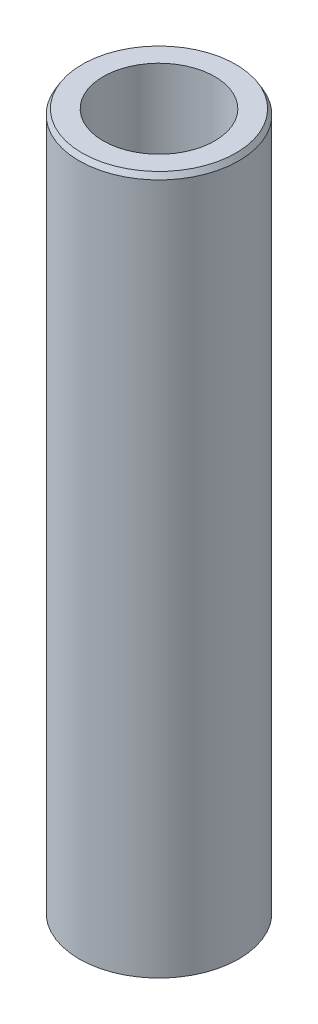
ISO-10303-21;
HEADER;
FILE_DESCRIPTION(('STEP AP214'),'2;1');
FILE_NAME('part.step','',(''),(''),'','','');
FILE_SCHEMA(('AUTOMOTIVE_DESIGN { 1 0 10303 214 1 1 1 1 }'));
ENDSEC;
DATA;
#1=APPLICATION_CONTEXT('core data for automotive mechanical design processes');
#2=APPLICATION_PROTOCOL_DEFINITION('international standard','automotive_design',2000,#1);
#3=PRODUCT_CONTEXT('',#1,'mechanical');
#4=PRODUCT('Part','Part','',(#3));
#5=PRODUCT_RELATED_PRODUCT_CATEGORY('part','',(#4));
#6=PRODUCT_DEFINITION_FORMATION('','',#4);
#7=PRODUCT_DEFINITION_CONTEXT('part definition',#1,'design');
#8=PRODUCT_DEFINITION('design','',#6,#7);
#9=PRODUCT_DEFINITION_SHAPE('','',#8);
#10=(LENGTH_UNIT() NAMED_UNIT(*) SI_UNIT(.MILLI.,.METRE.));
#11=(NAMED_UNIT(*) PLANE_ANGLE_UNIT() SI_UNIT($,.RADIAN.));
#12=(NAMED_UNIT(*) SI_UNIT($,.STERADIAN.) SOLID_ANGLE_UNIT());
#13=UNCERTAINTY_MEASURE_WITH_UNIT(LENGTH_MEASURE(1.E-05),#10,'distance_accuracy_value','');
#14=(GEOMETRIC_REPRESENTATION_CONTEXT(3) GLOBAL_UNCERTAINTY_ASSIGNED_CONTEXT((#13)) GLOBAL_UNIT_ASSIGNED_CONTEXT((#10,
#11,#12)) REPRESENTATION_CONTEXT('',''));
#15=CARTESIAN_POINT('',(0.,0.,0.));
#16=DIRECTION('',(0.,0.,1.));
#17=DIRECTION('',(1.,0.,0.));
#18=AXIS2_PLACEMENT_3D('',#15,#16,#17);
#19=CARTESIAN_POINT('',(0.,503.649247923404,0.));
#20=DIRECTION('',(0.,-1.,0.));
#21=DIRECTION('',(0.,0.,-1.));
#22=AXIS2_PLACEMENT_3D('',#19,#20,#21);
#23=CYLINDRICAL_SURFACE('',#22,57.5);
#24=CARTESIAN_POINT('',(0.,499.885237732269,0.));
#25=DIRECTION('',(0.,1.,0.));
#26=DIRECTION('',(0.,0.,1.));
#27=AXIS2_PLACEMENT_3D('',#24,#25,#26);
#28=CIRCLE('',#27,57.5);
#29=CARTESIAN_POINT('',(0.,499.885237732269,57.5));
#30=VERTEX_POINT('',#29);
#31=EDGE_CURVE('E50',#30,#30,#28,.F.);
#32=ORIENTED_EDGE('',*,*,#31,.T.);
#33=EDGE_LOOP('',(#32));
#34=FACE_BOUND('',#33,.T.);
#35=CARTESIAN_POINT('',(0.,2.17315229708426,0.));
#36=DIRECTION('',(0.,1.,0.));
#37=DIRECTION('',(0.,0.,1.));
#38=AXIS2_PLACEMENT_3D('',#35,#36,#37);
#39=CIRCLE('',#38,57.5);
#40=CARTESIAN_POINT('',(0.,2.17315229708426,57.5));
#41=VERTEX_POINT('',#40);
#42=EDGE_CURVE('E51',#41,#41,#39,.T.);
#43=ORIENTED_EDGE('',*,*,#42,.T.);
#44=EDGE_LOOP('',(#43));
#45=FACE_BOUND('',#44,.T.);
#46=ADVANCED_FACE('F39',(#34,#45),#23,.T.);
#47=CARTESIAN_POINT('',(0.,503.649247923404,0.));
#48=DIRECTION('',(0.,1.,0.));
#49=DIRECTION('',(0.,0.,1.));
#50=AXIS2_PLACEMENT_3D('',#47,#48,#49);
#51=PLANE('',#50);
#52=CARTESIAN_POINT('',(0.,503.649247923404,0.));
#53=DIRECTION('',(0.,1.,0.));
#54=DIRECTION('',(0.,0.,1.));
#55=AXIS2_PLACEMENT_3D('',#52,#53,#54);
#56=CIRCLE('',#55,55.3268477029157);
#57=CARTESIAN_POINT('',(0.,503.649247923404,55.3268477029157));
#58=VERTEX_POINT('',#57);
#59=EDGE_CURVE('E54',#58,#58,#56,.T.);
#60=ORIENTED_EDGE('',*,*,#59,.T.);
#61=EDGE_LOOP('',(#60));
#62=FACE_BOUND('',#61,.T.);
#63=CARTESIAN_POINT('',(0.,503.649247923404,0.));
#64=DIRECTION('',(0.,1.,0.));
#65=DIRECTION('',(0.,0.,1.));
#66=AXIS2_PLACEMENT_3D('',#63,#64,#65);
#67=CIRCLE('',#66,40.1594124195011);
#68=CARTESIAN_POINT('',(0.,503.649247923404,40.1594124195011));
#69=VERTEX_POINT('',#68);
#70=EDGE_CURVE('E58',#69,#69,#67,.T.);
#71=ORIENTED_EDGE('',*,*,#70,.F.);
#72=EDGE_LOOP('',(#71));
#73=FACE_BOUND('',#72,.T.);
#74=ADVANCED_FACE('F69',(#62,#73),#51,.T.);
#75=CARTESIAN_POINT('',(0.,0.,0.));
#76=DIRECTION('',(0.,1.,0.));
#77=DIRECTION('',(0.,0.,1.));
#78=AXIS2_PLACEMENT_3D('',#75,#76,#77);
#79=PLANE('',#78);
#80=CARTESIAN_POINT('',(0.,0.,0.));
#81=DIRECTION('',(0.,1.,0.));
#82=DIRECTION('',(0.,0.,1.));
#83=AXIS2_PLACEMENT_3D('',#80,#81,#82);
#84=CIRCLE('',#83,53.7359898088651);
#85=CARTESIAN_POINT('',(0.,0.,53.7359898088651));
#86=VERTEX_POINT('',#85);
#87=EDGE_CURVE('E10',#86,#86,#84,.F.);
#88=ORIENTED_EDGE('',*,*,#87,.T.);
#89=EDGE_LOOP('',(#88));
#90=FACE_BOUND('',#89,.T.);
#91=CARTESIAN_POINT('',(0.,0.,0.));
#92=DIRECTION('',(0.,1.,0.));
#93=DIRECTION('',(0.,0.,1.));
#94=AXIS2_PLACEMENT_3D('',#91,#92,#93);
#95=CIRCLE('',#94,40.1594124195011);
#96=CARTESIAN_POINT('',(0.,0.,40.1594124195011));
#97=VERTEX_POINT('',#96);
#98=EDGE_CURVE('E63',#97,#97,#95,.T.);
#99=ORIENTED_EDGE('',*,*,#98,.T.);
#100=EDGE_LOOP('',(#99));
#101=FACE_BOUND('',#100,.T.);
#102=ADVANCED_FACE('F75',(#90,#101),#79,.F.);
#103=CARTESIAN_POINT('',(0.,503.649247923404,0.));
#104=DIRECTION('',(0.,-1.,0.));
#105=DIRECTION('',(0.,0.,-1.));
#106=AXIS2_PLACEMENT_3D('',#103,#104,#105);
#107=CYLINDRICAL_SURFACE('',#106,40.1594124195011);
#108=ORIENTED_EDGE('',*,*,#70,.T.);
#109=EDGE_LOOP('',(#108));
#110=FACE_BOUND('',#109,.T.);
#111=ORIENTED_EDGE('',*,*,#98,.F.);
#112=EDGE_LOOP('',(#111));
#113=FACE_BOUND('',#112,.T.);
#114=ADVANCED_FACE('F70',(#110,#113),#107,.F.);
#115=CARTESIAN_POINT('',(0.,503.649247923404,0.));
#116=DIRECTION('',(0.,-1.,0.));
#117=DIRECTION('',(0.,0.,-1.));
#118=AXIS2_PLACEMENT_3D('',#115,#116,#117);
#119=CONICAL_SURFACE('',#118,55.3268477029157,0.523598775598295);
#120=ORIENTED_EDGE('',*,*,#31,.F.);
#121=EDGE_LOOP('',(#120));
#122=FACE_BOUND('',#121,.T.);
#123=ORIENTED_EDGE('',*,*,#59,.F.);
#124=EDGE_LOOP('',(#123));
#125=FACE_BOUND('',#124,.T.);
#126=ADVANCED_FACE('F81',(#122,#125),#119,.T.);
#127=CARTESIAN_POINT('',(0.,2.17315229708426,0.));
#128=DIRECTION('',(0.,1.,0.));
#129=DIRECTION('',(0.,0.,1.));
#130=AXIS2_PLACEMENT_3D('',#127,#128,#129);
#131=CONICAL_SURFACE('',#130,57.5,1.0471975511966);
#132=ORIENTED_EDGE('',*,*,#87,.F.);
#133=EDGE_LOOP('',(#132));
#134=FACE_BOUND('',#133,.T.);
#135=ORIENTED_EDGE('',*,*,#42,.F.);
#136=EDGE_LOOP('',(#135));
#137=FACE_BOUND('',#136,.T.);
#138=ADVANCED_FACE('F45',(#134,#137),#131,.T.);
#139=CLOSED_SHELL('',(#46,#74,#102,#114,#126,#138));
#140=MANIFOLD_SOLID_BREP('B2',#139);
#141=ADVANCED_BREP_SHAPE_REPRESENTATION('',(#18,#140),#14);
#142=SHAPE_DEFINITION_REPRESENTATION(#9,#141);
ENDSEC;
END-ISO-10303-21;
